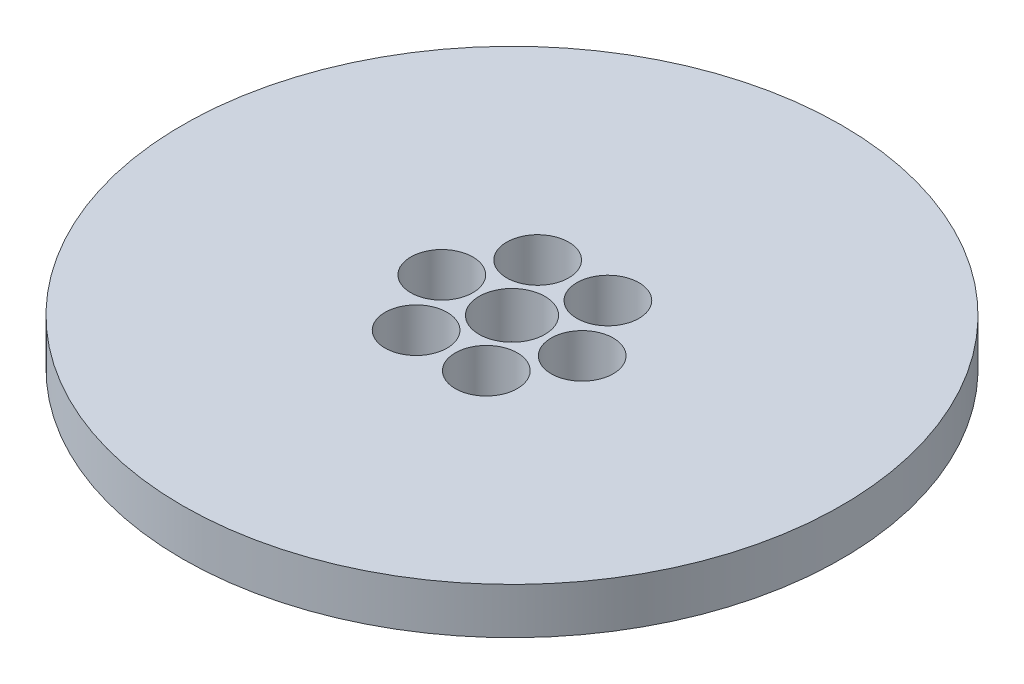
ISO-10303-21;
HEADER;
FILE_DESCRIPTION(('STEP AP214'),'2;1');
FILE_NAME('part.step','',(''),(''),'','','');
FILE_SCHEMA(('AUTOMOTIVE_DESIGN { 1 0 10303 214 1 1 1 1 }'));
ENDSEC;
DATA;
#1=APPLICATION_CONTEXT('core data for automotive mechanical design processes');
#2=APPLICATION_PROTOCOL_DEFINITION('international standard','automotive_design',2000,#1);
#3=PRODUCT_CONTEXT('',#1,'mechanical');
#4=PRODUCT('Part','Part','',(#3));
#5=PRODUCT_RELATED_PRODUCT_CATEGORY('part','',(#4));
#6=PRODUCT_DEFINITION_FORMATION('','',#4);
#7=PRODUCT_DEFINITION_CONTEXT('part definition',#1,'design');
#8=PRODUCT_DEFINITION('design','',#6,#7);
#9=PRODUCT_DEFINITION_SHAPE('','',#8);
#10=(LENGTH_UNIT() NAMED_UNIT(*) SI_UNIT(.MILLI.,.METRE.));
#11=(NAMED_UNIT(*) PLANE_ANGLE_UNIT() SI_UNIT($,.RADIAN.));
#12=(NAMED_UNIT(*) SI_UNIT($,.STERADIAN.) SOLID_ANGLE_UNIT());
#13=UNCERTAINTY_MEASURE_WITH_UNIT(LENGTH_MEASURE(1.E-05),#10,'distance_accuracy_value','');
#14=(GEOMETRIC_REPRESENTATION_CONTEXT(3) GLOBAL_UNCERTAINTY_ASSIGNED_CONTEXT((#13)) GLOBAL_UNIT_ASSIGNED_CONTEXT((#10,
#11,#12)) REPRESENTATION_CONTEXT('',''));
#15=CARTESIAN_POINT('',(0.,0.,0.));
#16=DIRECTION('',(0.,0.,1.));
#17=DIRECTION('',(1.,0.,0.));
#18=AXIS2_PLACEMENT_3D('',#15,#16,#17);
#19=CARTESIAN_POINT('',(0.,7.,0.));
#20=DIRECTION('',(0.,-1.,0.));
#21=DIRECTION('',(0.,0.,-1.));
#22=AXIS2_PLACEMENT_3D('',#19,#20,#21);
#23=CYLINDRICAL_SURFACE('',#22,50.);
#24=CARTESIAN_POINT('',(0.,7.,0.));
#25=DIRECTION('',(0.,1.,0.));
#26=DIRECTION('',(0.,0.,1.));
#27=AXIS2_PLACEMENT_3D('',#24,#25,#26);
#28=CIRCLE('',#27,50.);
#29=CARTESIAN_POINT('',(0.,7.,50.));
#30=VERTEX_POINT('',#29);
#31=EDGE_CURVE('E10',#30,#30,#28,.T.);
#32=ORIENTED_EDGE('',*,*,#31,.F.);
#33=EDGE_LOOP('',(#32));
#34=FACE_BOUND('',#33,.T.);
#35=CARTESIAN_POINT('',(0.,0.,0.));
#36=DIRECTION('',(0.,1.,0.));
#37=DIRECTION('',(0.,0.,1.));
#38=AXIS2_PLACEMENT_3D('',#35,#36,#37);
#39=CIRCLE('',#38,50.);
#40=CARTESIAN_POINT('',(0.,0.,50.));
#41=VERTEX_POINT('',#40);
#42=EDGE_CURVE('E37',#41,#41,#39,.T.);
#43=ORIENTED_EDGE('',*,*,#42,.T.);
#44=EDGE_LOOP('',(#43));
#45=FACE_BOUND('',#44,.T.);
#46=ADVANCED_FACE('F40',(#34,#45),#23,.T.);
#47=CARTESIAN_POINT('',(0.,7.,0.));
#48=DIRECTION('',(0.,1.,0.));
#49=DIRECTION('',(0.,0.,1.));
#50=AXIS2_PLACEMENT_3D('',#47,#48,#49);
#51=PLANE('',#50);
#52=CARTESIAN_POINT('',(10.650628421249,7.,0.));
#53=DIRECTION('',(0.,1.,0.));
#54=DIRECTION('',(0.,0.,-1.));
#55=AXIS2_PLACEMENT_3D('',#52,#53,#54);
#56=CIRCLE('',#55,4.70732181515534);
#57=CARTESIAN_POINT('',(10.650628421249,7.,-4.70732181515534));
#58=VERTEX_POINT('',#57);
#59=EDGE_CURVE('E71',#58,#58,#56,.T.);
#60=ORIENTED_EDGE('',*,*,#59,.F.);
#61=EDGE_LOOP('',(#60));
#62=FACE_BOUND('',#61,.T.);
#63=CARTESIAN_POINT('',(5.32531421062454,7.,9.22371477907016));
#64=DIRECTION('',(0.,1.,0.));
#65=DIRECTION('',(0.866025403784436,0.,-0.500000000000004));
#66=AXIS2_PLACEMENT_3D('',#63,#64,#65);
#67=CIRCLE('',#66,4.70732181515534);
#68=CARTESIAN_POINT('',(9.40197448633773,7.,6.87005387149247));
#69=VERTEX_POINT('',#68);
#70=EDGE_CURVE('E70',#69,#69,#67,.T.);
#71=ORIENTED_EDGE('',*,*,#70,.F.);
#72=EDGE_LOOP('',(#71));
#73=FACE_BOUND('',#72,.T.);
#74=CARTESIAN_POINT('',(5.32531421062441,7.,-9.22371477907023));
#75=DIRECTION('',(0.,1.,0.));
#76=DIRECTION('',(-0.866025403784443,0.,-0.499999999999992));
#77=AXIS2_PLACEMENT_3D('',#74,#75,#76);
#78=CIRCLE('',#77,4.70732181515534);
#79=CARTESIAN_POINT('',(1.24865393491119,7.,-11.5773756866479));
#80=VERTEX_POINT('',#79);
#81=EDGE_CURVE('E84',#80,#80,#78,.T.);
#82=ORIENTED_EDGE('',*,*,#81,.F.);
#83=EDGE_LOOP('',(#82));
#84=FACE_BOUND('',#83,.T.);
#85=CARTESIAN_POINT('',(-5.32531421062461,7.,-9.22371477907012));
#86=DIRECTION('',(0.,1.,0.));
#87=DIRECTION('',(-0.866025403784433,0.,0.50000000000001));
#88=AXIS2_PLACEMENT_3D('',#85,#86,#87);
#89=CIRCLE('',#88,4.70732181515534);
#90=CARTESIAN_POINT('',(-9.40197448633778,7.,-6.8700538714924));
#91=VERTEX_POINT('',#90);
#92=EDGE_CURVE('E78',#91,#91,#89,.T.);
#93=ORIENTED_EDGE('',*,*,#92,.F.);
#94=EDGE_LOOP('',(#93));
#95=FACE_BOUND('',#94,.T.);
#96=CARTESIAN_POINT('',(-5.32531421062448,7.,9.2237147790702));
#97=DIRECTION('',(0.,1.,0.));
#98=DIRECTION('',(0.86602540378444,0.,0.499999999999998));
#99=AXIS2_PLACEMENT_3D('',#96,#97,#98);
#100=CIRCLE('',#99,4.70732181515534);
#101=CARTESIAN_POINT('',(-1.24865393491127,7.,11.5773756866479));
#102=VERTEX_POINT('',#101);
#103=EDGE_CURVE('E61',#102,#102,#100,.T.);
#104=ORIENTED_EDGE('',*,*,#103,.F.);
#105=EDGE_LOOP('',(#104));
#106=FACE_BOUND('',#105,.T.);
#107=CARTESIAN_POINT('',(-10.650628421249,7.,0.));
#108=DIRECTION('',(0.,1.,0.));
#109=DIRECTION('',(0.,0.,1.));
#110=AXIS2_PLACEMENT_3D('',#107,#108,#109);
#111=CIRCLE('',#110,4.70732181515534);
#112=CARTESIAN_POINT('',(-10.650628421249,7.,4.70732181515534));
#113=VERTEX_POINT('',#112);
#114=EDGE_CURVE('E54',#113,#113,#111,.T.);
#115=ORIENTED_EDGE('',*,*,#114,.F.);
#116=EDGE_LOOP('',(#115));
#117=FACE_BOUND('',#116,.T.);
#118=CARTESIAN_POINT('',(0.,7.,0.));
#119=DIRECTION('',(0.,1.,0.));
#120=DIRECTION('',(0.,0.,1.));
#121=AXIS2_PLACEMENT_3D('',#118,#119,#120);
#122=CIRCLE('',#121,5.);
#123=CARTESIAN_POINT('',(0.,7.,5.));
#124=VERTEX_POINT('',#123);
#125=EDGE_CURVE('E50',#124,#124,#122,.T.);
#126=ORIENTED_EDGE('',*,*,#125,.F.);
#127=EDGE_LOOP('',(#126));
#128=FACE_BOUND('',#127,.T.);
#129=ORIENTED_EDGE('',*,*,#31,.T.);
#130=EDGE_LOOP('',(#129));
#131=FACE_BOUND('',#130,.T.);
#132=ADVANCED_FACE('F99',(#62,#73,#84,#95,#106,#117,#128,#131),#51,.T.);
#133=CARTESIAN_POINT('',(0.,0.,0.));
#134=DIRECTION('',(0.,1.,0.));
#135=DIRECTION('',(0.,0.,1.));
#136=AXIS2_PLACEMENT_3D('',#133,#134,#135);
#137=PLANE('',#136);
#138=CARTESIAN_POINT('',(0.,0.,0.));
#139=DIRECTION('',(0.,1.,0.));
#140=DIRECTION('',(0.,0.,1.));
#141=AXIS2_PLACEMENT_3D('',#138,#139,#140);
#142=CIRCLE('',#141,5.);
#143=CARTESIAN_POINT('',(0.,0.,5.));
#144=VERTEX_POINT('',#143);
#145=EDGE_CURVE('E47',#144,#144,#142,.T.);
#146=ORIENTED_EDGE('',*,*,#145,.T.);
#147=EDGE_LOOP('',(#146));
#148=FACE_BOUND('',#147,.T.);
#149=ORIENTED_EDGE('',*,*,#42,.F.);
#150=EDGE_LOOP('',(#149));
#151=FACE_BOUND('',#150,.T.);
#152=ADVANCED_FACE('F103',(#148,#151),#137,.F.);
#153=CARTESIAN_POINT('',(0.,7.,0.));
#154=DIRECTION('',(0.,-1.,0.));
#155=DIRECTION('',(0.,0.,-1.));
#156=AXIS2_PLACEMENT_3D('',#153,#154,#155);
#157=CYLINDRICAL_SURFACE('',#156,5.);
#158=ORIENTED_EDGE('',*,*,#125,.T.);
#159=EDGE_LOOP('',(#158));
#160=FACE_BOUND('',#159,.T.);
#161=ORIENTED_EDGE('',*,*,#145,.F.);
#162=EDGE_LOOP('',(#161));
#163=FACE_BOUND('',#162,.T.);
#164=ADVANCED_FACE('F111',(#160,#163),#157,.F.);
#165=CARTESIAN_POINT('',(-10.650628421249,0.268663617887898,0.));
#166=DIRECTION('',(0.,1.,0.));
#167=DIRECTION('',(0.,0.,1.));
#168=AXIS2_PLACEMENT_3D('',#165,#166,#167);
#169=CYLINDRICAL_SURFACE('',#168,4.70732181515534);
#170=CARTESIAN_POINT('',(-10.650628421249,0.268663617887898,0.));
#171=DIRECTION('',(0.,1.,0.));
#172=DIRECTION('',(0.,0.,1.));
#173=AXIS2_PLACEMENT_3D('',#170,#171,#172);
#174=CIRCLE('',#173,4.70732181515534);
#175=CARTESIAN_POINT('',(-10.650628421249,0.268663617887898,4.70732181515534));
#176=VERTEX_POINT('',#175);
#177=EDGE_CURVE('E55',#176,#176,#174,.T.);
#178=ORIENTED_EDGE('',*,*,#177,.F.);
#179=EDGE_LOOP('',(#178));
#180=FACE_BOUND('',#179,.T.);
#181=ORIENTED_EDGE('',*,*,#114,.T.);
#182=EDGE_LOOP('',(#181));
#183=FACE_BOUND('',#182,.T.);
#184=ADVANCED_FACE('F120',(#180,#183),#169,.F.);
#185=CARTESIAN_POINT('',(-10.650628421249,0.268663617887898,0.));
#186=DIRECTION('',(0.,1.,0.));
#187=DIRECTION('',(0.,0.,1.));
#188=AXIS2_PLACEMENT_3D('',#185,#186,#187);
#189=PLANE('',#188);
#190=ORIENTED_EDGE('',*,*,#177,.T.);
#191=EDGE_LOOP('',(#190));
#192=FACE_BOUND('',#191,.T.);
#193=ADVANCED_FACE('F150',(#192),#189,.T.);
#194=CARTESIAN_POINT('',(-5.32531421062448,0.268663617887898,9.2237147790702));
#195=DIRECTION('',(0.,1.,0.));
#196=DIRECTION('',(0.,0.,1.));
#197=AXIS2_PLACEMENT_3D('',#194,#195,#196);
#198=CYLINDRICAL_SURFACE('',#197,4.70732181515534);
#199=CARTESIAN_POINT('',(-5.32531421062448,0.268663617887898,9.2237147790702));
#200=DIRECTION('',(0.,1.,0.));
#201=DIRECTION('',(0.86602540378444,0.,0.499999999999998));
#202=AXIS2_PLACEMENT_3D('',#199,#200,#201);
#203=CIRCLE('',#202,4.70732181515534);
#204=CARTESIAN_POINT('',(-1.24865393491127,0.268663617887898,11.5773756866479));
#205=VERTEX_POINT('',#204);
#206=EDGE_CURVE('E59',#205,#205,#203,.T.);
#207=ORIENTED_EDGE('',*,*,#206,.F.);
#208=EDGE_LOOP('',(#207));
#209=FACE_BOUND('',#208,.T.);
#210=ORIENTED_EDGE('',*,*,#103,.T.);
#211=EDGE_LOOP('',(#210));
#212=FACE_BOUND('',#211,.T.);
#213=ADVANCED_FACE('F154',(#209,#212),#198,.F.);
#214=CARTESIAN_POINT('',(-5.32531421062448,0.268663617887898,9.2237147790702));
#215=DIRECTION('',(0.,1.,0.));
#216=DIRECTION('',(0.86602540378444,0.,0.499999999999998));
#217=AXIS2_PLACEMENT_3D('',#214,#215,#216);
#218=PLANE('',#217);
#219=ORIENTED_EDGE('',*,*,#206,.T.);
#220=EDGE_LOOP('',(#219));
#221=FACE_BOUND('',#220,.T.);
#222=ADVANCED_FACE('F166',(#221),#218,.T.);
#223=CARTESIAN_POINT('',(-5.32531421062461,0.268663617887898,-9.22371477907012));
#224=DIRECTION('',(0.,1.,0.));
#225=DIRECTION('',(0.,0.,1.));
#226=AXIS2_PLACEMENT_3D('',#223,#224,#225);
#227=CYLINDRICAL_SURFACE('',#226,4.70732181515534);
#228=CARTESIAN_POINT('',(-5.32531421062461,0.268663617887898,-9.22371477907012));
#229=DIRECTION('',(0.,1.,0.));
#230=DIRECTION('',(-0.866025403784433,0.,0.50000000000001));
#231=AXIS2_PLACEMENT_3D('',#228,#229,#230);
#232=CIRCLE('',#231,4.70732181515534);
#233=CARTESIAN_POINT('',(-9.40197448633778,0.268663617887898,-6.8700538714924));
#234=VERTEX_POINT('',#233);
#235=EDGE_CURVE('E85',#234,#234,#232,.T.);
#236=ORIENTED_EDGE('',*,*,#235,.F.);
#237=EDGE_LOOP('',(#236));
#238=FACE_BOUND('',#237,.T.);
#239=ORIENTED_EDGE('',*,*,#92,.T.);
#240=EDGE_LOOP('',(#239));
#241=FACE_BOUND('',#240,.T.);
#242=ADVANCED_FACE('F177',(#238,#241),#227,.F.);
#243=CARTESIAN_POINT('',(-5.32531421062461,0.268663617887898,-9.22371477907012));
#244=DIRECTION('',(0.,1.,0.));
#245=DIRECTION('',(-0.866025403784433,0.,0.50000000000001));
#246=AXIS2_PLACEMENT_3D('',#243,#244,#245);
#247=PLANE('',#246);
#248=ORIENTED_EDGE('',*,*,#235,.T.);
#249=EDGE_LOOP('',(#248));
#250=FACE_BOUND('',#249,.T.);
#251=ADVANCED_FACE('F96',(#250),#247,.T.);
#252=CARTESIAN_POINT('',(5.32531421062441,0.268663617887898,-9.22371477907023));
#253=DIRECTION('',(0.,1.,0.));
#254=DIRECTION('',(0.,0.,1.));
#255=AXIS2_PLACEMENT_3D('',#252,#253,#254);
#256=CYLINDRICAL_SURFACE('',#255,4.70732181515534);
#257=CARTESIAN_POINT('',(5.32531421062441,0.268663617887898,-9.22371477907023));
#258=DIRECTION('',(0.,1.,0.));
#259=DIRECTION('',(-0.866025403784443,0.,-0.499999999999992));
#260=AXIS2_PLACEMENT_3D('',#257,#258,#259);
#261=CIRCLE('',#260,4.70732181515534);
#262=CARTESIAN_POINT('',(1.24865393491119,0.268663617887898,-11.5773756866479));
#263=VERTEX_POINT('',#262);
#264=EDGE_CURVE('E76',#263,#263,#261,.T.);
#265=ORIENTED_EDGE('',*,*,#264,.F.);
#266=EDGE_LOOP('',(#265));
#267=FACE_BOUND('',#266,.T.);
#268=ORIENTED_EDGE('',*,*,#81,.T.);
#269=EDGE_LOOP('',(#268));
#270=FACE_BOUND('',#269,.T.);
#271=ADVANCED_FACE('F91',(#267,#270),#256,.F.);
#272=CARTESIAN_POINT('',(5.32531421062441,0.268663617887898,-9.22371477907023));
#273=DIRECTION('',(0.,1.,0.));
#274=DIRECTION('',(-0.866025403784443,0.,-0.499999999999992));
#275=AXIS2_PLACEMENT_3D('',#272,#273,#274);
#276=PLANE('',#275);
#277=ORIENTED_EDGE('',*,*,#264,.T.);
#278=EDGE_LOOP('',(#277));
#279=FACE_BOUND('',#278,.T.);
#280=ADVANCED_FACE('F93',(#279),#276,.T.);
#281=CARTESIAN_POINT('',(5.32531421062454,0.268663617887898,9.22371477907016));
#282=DIRECTION('',(0.,1.,0.));
#283=DIRECTION('',(0.,0.,1.));
#284=AXIS2_PLACEMENT_3D('',#281,#282,#283);
#285=CYLINDRICAL_SURFACE('',#284,4.70732181515534);
#286=CARTESIAN_POINT('',(5.32531421062454,0.268663617887898,9.22371477907016));
#287=DIRECTION('',(0.,1.,0.));
#288=DIRECTION('',(0.866025403784436,0.,-0.500000000000004));
#289=AXIS2_PLACEMENT_3D('',#286,#287,#288);
#290=CIRCLE('',#289,4.70732181515534);
#291=CARTESIAN_POINT('',(9.40197448633773,0.268663617887898,6.87005387149247));
#292=VERTEX_POINT('',#291);
#293=EDGE_CURVE('E63',#292,#292,#290,.T.);
#294=ORIENTED_EDGE('',*,*,#293,.F.);
#295=EDGE_LOOP('',(#294));
#296=FACE_BOUND('',#295,.T.);
#297=ORIENTED_EDGE('',*,*,#70,.T.);
#298=EDGE_LOOP('',(#297));
#299=FACE_BOUND('',#298,.T.);
#300=ADVANCED_FACE('F208',(#296,#299),#285,.F.);
#301=CARTESIAN_POINT('',(5.32531421062454,0.268663617887898,9.22371477907016));
#302=DIRECTION('',(0.,1.,0.));
#303=DIRECTION('',(0.866025403784436,0.,-0.500000000000004));
#304=AXIS2_PLACEMENT_3D('',#301,#302,#303);
#305=PLANE('',#304);
#306=ORIENTED_EDGE('',*,*,#293,.T.);
#307=EDGE_LOOP('',(#306));
#308=FACE_BOUND('',#307,.T.);
#309=ADVANCED_FACE('F216',(#308),#305,.T.);
#310=CARTESIAN_POINT('',(10.650628421249,0.268663617887898,0.));
#311=DIRECTION('',(0.,1.,0.));
#312=DIRECTION('',(0.,0.,1.));
#313=AXIS2_PLACEMENT_3D('',#310,#311,#312);
#314=CYLINDRICAL_SURFACE('',#313,4.70732181515534);
#315=CARTESIAN_POINT('',(10.650628421249,0.268663617887898,0.));
#316=DIRECTION('',(0.,1.,0.));
#317=DIRECTION('',(0.,0.,-1.));
#318=AXIS2_PLACEMENT_3D('',#315,#316,#317);
#319=CIRCLE('',#318,4.70732181515534);
#320=CARTESIAN_POINT('',(10.650628421249,0.268663617887898,-4.70732181515534));
#321=VERTEX_POINT('',#320);
#322=EDGE_CURVE('E69',#321,#321,#319,.T.);
#323=ORIENTED_EDGE('',*,*,#322,.F.);
#324=EDGE_LOOP('',(#323));
#325=FACE_BOUND('',#324,.T.);
#326=ORIENTED_EDGE('',*,*,#59,.T.);
#327=EDGE_LOOP('',(#326));
#328=FACE_BOUND('',#327,.T.);
#329=ADVANCED_FACE('F223',(#325,#328),#314,.F.);
#330=CARTESIAN_POINT('',(10.650628421249,0.268663617887898,0.));
#331=DIRECTION('',(0.,1.,0.));
#332=DIRECTION('',(0.,0.,-1.));
#333=AXIS2_PLACEMENT_3D('',#330,#331,#332);
#334=PLANE('',#333);
#335=ORIENTED_EDGE('',*,*,#322,.T.);
#336=EDGE_LOOP('',(#335));
#337=FACE_BOUND('',#336,.T.);
#338=ADVANCED_FACE('F233',(#337),#334,.T.);
#339=CLOSED_SHELL('',(#46,#132,#152,#164,#184,#193,#213,#222,#242,#251,#271,#280,#300,#309,#329,#338));
#340=MANIFOLD_SOLID_BREP('B2',#339);
#341=ADVANCED_BREP_SHAPE_REPRESENTATION('',(#18,#340),#14);
#342=SHAPE_DEFINITION_REPRESENTATION(#9,#341);
ENDSEC;
END-ISO-10303-21;
